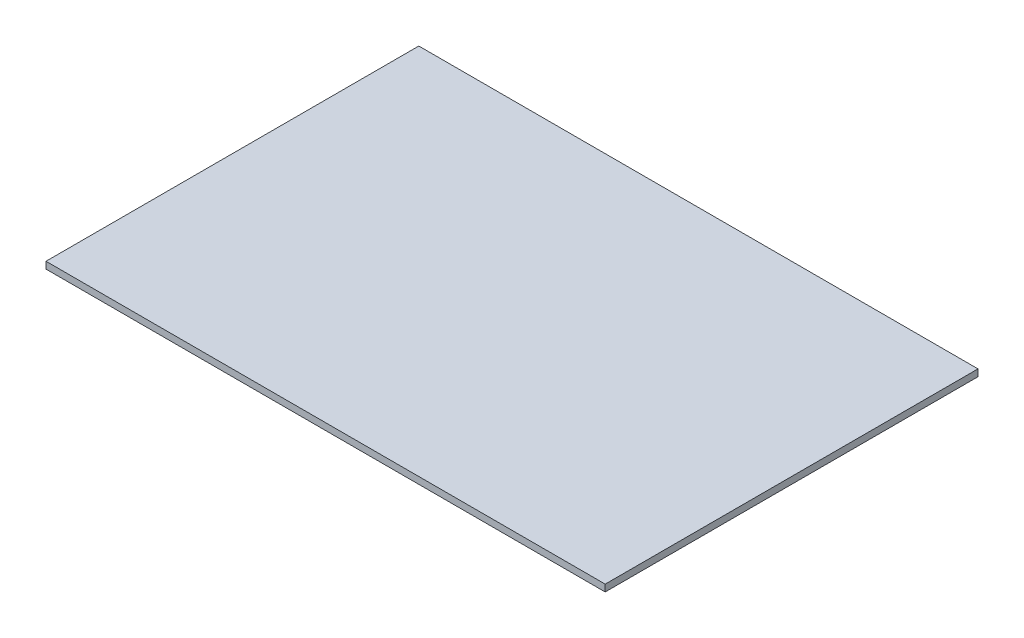
ISO-10303-21;
HEADER;
FILE_DESCRIPTION(('STEP AP214'),'2;1');
FILE_NAME('part.step','',(''),(''),'','','');
FILE_SCHEMA(('AUTOMOTIVE_DESIGN { 1 0 10303 214 1 1 1 1 }'));
ENDSEC;
DATA;
#1=APPLICATION_CONTEXT('core data for automotive mechanical design processes');
#2=APPLICATION_PROTOCOL_DEFINITION('international standard','automotive_design',2000,#1);
#3=PRODUCT_CONTEXT('',#1,'mechanical');
#4=PRODUCT('Part','Part','',(#3));
#5=PRODUCT_RELATED_PRODUCT_CATEGORY('part','',(#4));
#6=PRODUCT_DEFINITION_FORMATION('','',#4);
#7=PRODUCT_DEFINITION_CONTEXT('part definition',#1,'design');
#8=PRODUCT_DEFINITION('design','',#6,#7);
#9=PRODUCT_DEFINITION_SHAPE('','',#8);
#10=(LENGTH_UNIT() NAMED_UNIT(*) SI_UNIT(.MILLI.,.METRE.));
#11=(NAMED_UNIT(*) PLANE_ANGLE_UNIT() SI_UNIT($,.RADIAN.));
#12=(NAMED_UNIT(*) SI_UNIT($,.STERADIAN.) SOLID_ANGLE_UNIT());
#13=UNCERTAINTY_MEASURE_WITH_UNIT(LENGTH_MEASURE(1.E-05),#10,'distance_accuracy_value','');
#14=(GEOMETRIC_REPRESENTATION_CONTEXT(3) GLOBAL_UNCERTAINTY_ASSIGNED_CONTEXT((#13)) GLOBAL_UNIT_ASSIGNED_CONTEXT((#10,
#11,#12)) REPRESENTATION_CONTEXT('',''));
#15=CARTESIAN_POINT('',(0.,0.,0.));
#16=DIRECTION('',(0.,0.,1.));
#17=DIRECTION('',(1.,0.,0.));
#18=AXIS2_PLACEMENT_3D('',#15,#16,#17);
#19=CARTESIAN_POINT('',(123.,3.,82.));
#20=DIRECTION('',(-1.,0.,0.));
#21=DIRECTION('',(0.,0.,1.));
#22=AXIS2_PLACEMENT_3D('',#19,#20,#21);
#23=PLANE('',#22);
#24=DIRECTION('',(0.,0.,-1.));
#25=VECTOR('',#24,1.);
#26=CARTESIAN_POINT('',(123.,0.,82.));
#27=LINE('',#26,#25);
#28=CARTESIAN_POINT('',(123.,0.,82.));
#29=VERTEX_POINT('',#28);
#30=CARTESIAN_POINT('',(123.,0.,-82.));
#31=VERTEX_POINT('',#30);
#32=EDGE_CURVE('E102',#29,#31,#27,.T.);
#33=ORIENTED_EDGE('',*,*,#32,.T.);
#34=DIRECTION('',(0.,-1.,0.));
#35=VECTOR('',#34,1.);
#36=CARTESIAN_POINT('',(123.,3.,-82.));
#37=LINE('',#36,#35);
#38=CARTESIAN_POINT('',(123.,3.,-82.));
#39=VERTEX_POINT('',#38);
#40=EDGE_CURVE('E11',#39,#31,#37,.T.);
#41=ORIENTED_EDGE('',*,*,#40,.F.);
#42=DIRECTION('',(0.,0.,-1.));
#43=VECTOR('',#42,1.);
#44=CARTESIAN_POINT('',(123.,3.,82.));
#45=LINE('',#44,#43);
#46=CARTESIAN_POINT('',(123.,3.,82.));
#47=VERTEX_POINT('',#46);
#48=EDGE_CURVE('E90',#47,#39,#45,.T.);
#49=ORIENTED_EDGE('',*,*,#48,.F.);
#50=DIRECTION('',(0.,-1.,0.));
#51=VECTOR('',#50,1.);
#52=CARTESIAN_POINT('',(123.,3.,82.));
#53=LINE('',#52,#51);
#54=EDGE_CURVE('E98',#47,#29,#53,.T.);
#55=ORIENTED_EDGE('',*,*,#54,.T.);
#56=EDGE_LOOP('',(#33,#41,#49,#55));
#57=FACE_BOUND('',#56,.T.);
#58=ADVANCED_FACE('F39',(#57),#23,.F.);
#59=CARTESIAN_POINT('',(-123.,3.,-82.));
#60=DIRECTION('',(0.,0.,1.));
#61=DIRECTION('',(1.,0.,0.));
#62=AXIS2_PLACEMENT_3D('',#59,#60,#61);
#63=PLANE('',#62);
#64=DIRECTION('',(-1.,0.,0.));
#65=VECTOR('',#64,1.);
#66=CARTESIAN_POINT('',(-123.,0.,-82.));
#67=LINE('',#66,#65);
#68=CARTESIAN_POINT('',(-123.,0.,-82.));
#69=VERTEX_POINT('',#68);
#70=EDGE_CURVE('E94',#31,#69,#67,.T.);
#71=ORIENTED_EDGE('',*,*,#70,.T.);
#72=DIRECTION('',(0.,-1.,0.));
#73=VECTOR('',#72,1.);
#74=CARTESIAN_POINT('',(-123.,3.,-82.));
#75=LINE('',#74,#73);
#76=CARTESIAN_POINT('',(-123.,3.,-82.));
#77=VERTEX_POINT('',#76);
#78=EDGE_CURVE('E47',#77,#69,#75,.T.);
#79=ORIENTED_EDGE('',*,*,#78,.F.);
#80=DIRECTION('',(-1.,0.,0.));
#81=VECTOR('',#80,1.);
#82=CARTESIAN_POINT('',(-123.,3.,-82.));
#83=LINE('',#82,#81);
#84=EDGE_CURVE('E85',#39,#77,#83,.T.);
#85=ORIENTED_EDGE('',*,*,#84,.F.);
#86=ORIENTED_EDGE('',*,*,#40,.T.);
#87=EDGE_LOOP('',(#71,#79,#85,#86));
#88=FACE_BOUND('',#87,.T.);
#89=ADVANCED_FACE('F93',(#88),#63,.F.);
#90=CARTESIAN_POINT('',(-123.,3.,82.));
#91=DIRECTION('',(1.,0.,0.));
#92=DIRECTION('',(0.,0.,-1.));
#93=AXIS2_PLACEMENT_3D('',#90,#91,#92);
#94=PLANE('',#93);
#95=DIRECTION('',(0.,0.,1.));
#96=VECTOR('',#95,1.);
#97=CARTESIAN_POINT('',(-123.,0.,82.));
#98=LINE('',#97,#96);
#99=CARTESIAN_POINT('',(-123.,0.,82.));
#100=VERTEX_POINT('',#99);
#101=EDGE_CURVE('E72',#69,#100,#98,.T.);
#102=ORIENTED_EDGE('',*,*,#101,.T.);
#103=DIRECTION('',(0.,-1.,0.));
#104=VECTOR('',#103,1.);
#105=CARTESIAN_POINT('',(-123.,3.,82.));
#106=LINE('',#105,#104);
#107=CARTESIAN_POINT('',(-123.,3.,82.));
#108=VERTEX_POINT('',#107);
#109=EDGE_CURVE('E95',#108,#100,#106,.T.);
#110=ORIENTED_EDGE('',*,*,#109,.F.);
#111=DIRECTION('',(0.,0.,1.));
#112=VECTOR('',#111,1.);
#113=CARTESIAN_POINT('',(-123.,3.,82.));
#114=LINE('',#113,#112);
#115=EDGE_CURVE('E88',#77,#108,#114,.T.);
#116=ORIENTED_EDGE('',*,*,#115,.F.);
#117=ORIENTED_EDGE('',*,*,#78,.T.);
#118=EDGE_LOOP('',(#102,#110,#116,#117));
#119=FACE_BOUND('',#118,.T.);
#120=ADVANCED_FACE('F96',(#119),#94,.F.);
#121=CARTESIAN_POINT('',(-123.,3.,82.));
#122=DIRECTION('',(0.,0.,-1.));
#123=DIRECTION('',(-1.,0.,0.));
#124=AXIS2_PLACEMENT_3D('',#121,#122,#123);
#125=PLANE('',#124);
#126=DIRECTION('',(1.,0.,0.));
#127=VECTOR('',#126,1.);
#128=CARTESIAN_POINT('',(-123.,0.,82.));
#129=LINE('',#128,#127);
#130=EDGE_CURVE('E78',#100,#29,#129,.T.);
#131=ORIENTED_EDGE('',*,*,#130,.T.);
#132=ORIENTED_EDGE('',*,*,#54,.F.);
#133=DIRECTION('',(1.,0.,0.));
#134=VECTOR('',#133,1.);
#135=CARTESIAN_POINT('',(-123.,3.,82.));
#136=LINE('',#135,#134);
#137=EDGE_CURVE('E55',#108,#47,#136,.T.);
#138=ORIENTED_EDGE('',*,*,#137,.F.);
#139=ORIENTED_EDGE('',*,*,#109,.T.);
#140=EDGE_LOOP('',(#131,#132,#138,#139));
#141=FACE_BOUND('',#140,.T.);
#142=ADVANCED_FACE('F109',(#141),#125,.F.);
#143=CARTESIAN_POINT('',(0.,3.,0.));
#144=DIRECTION('',(0.,-1.,0.));
#145=DIRECTION('',(0.,0.,-1.));
#146=AXIS2_PLACEMENT_3D('',#143,#144,#145);
#147=PLANE('',#146);
#148=ORIENTED_EDGE('',*,*,#48,.T.);
#149=ORIENTED_EDGE('',*,*,#84,.T.);
#150=ORIENTED_EDGE('',*,*,#115,.T.);
#151=ORIENTED_EDGE('',*,*,#137,.T.);
#152=EDGE_LOOP('',(#148,#149,#150,#151));
#153=FACE_BOUND('',#152,.T.);
#154=ADVANCED_FACE('F86',(#153),#147,.F.);
#155=CARTESIAN_POINT('',(0.,0.,0.));
#156=DIRECTION('',(0.,-1.,0.));
#157=DIRECTION('',(0.,0.,-1.));
#158=AXIS2_PLACEMENT_3D('',#155,#156,#157);
#159=PLANE('',#158);
#160=ORIENTED_EDGE('',*,*,#32,.F.);
#161=ORIENTED_EDGE('',*,*,#130,.F.);
#162=ORIENTED_EDGE('',*,*,#101,.F.);
#163=ORIENTED_EDGE('',*,*,#70,.F.);
#164=EDGE_LOOP('',(#160,#161,#162,#163));
#165=FACE_BOUND('',#164,.T.);
#166=ADVANCED_FACE('F112',(#165),#159,.T.);
#167=CLOSED_SHELL('',(#58,#89,#120,#142,#154,#166));
#168=MANIFOLD_SOLID_BREP('B2',#167);
#169=ADVANCED_BREP_SHAPE_REPRESENTATION('',(#18,#168),#14);
#170=SHAPE_DEFINITION_REPRESENTATION(#9,#169);
ENDSEC;
END-ISO-10303-21;
